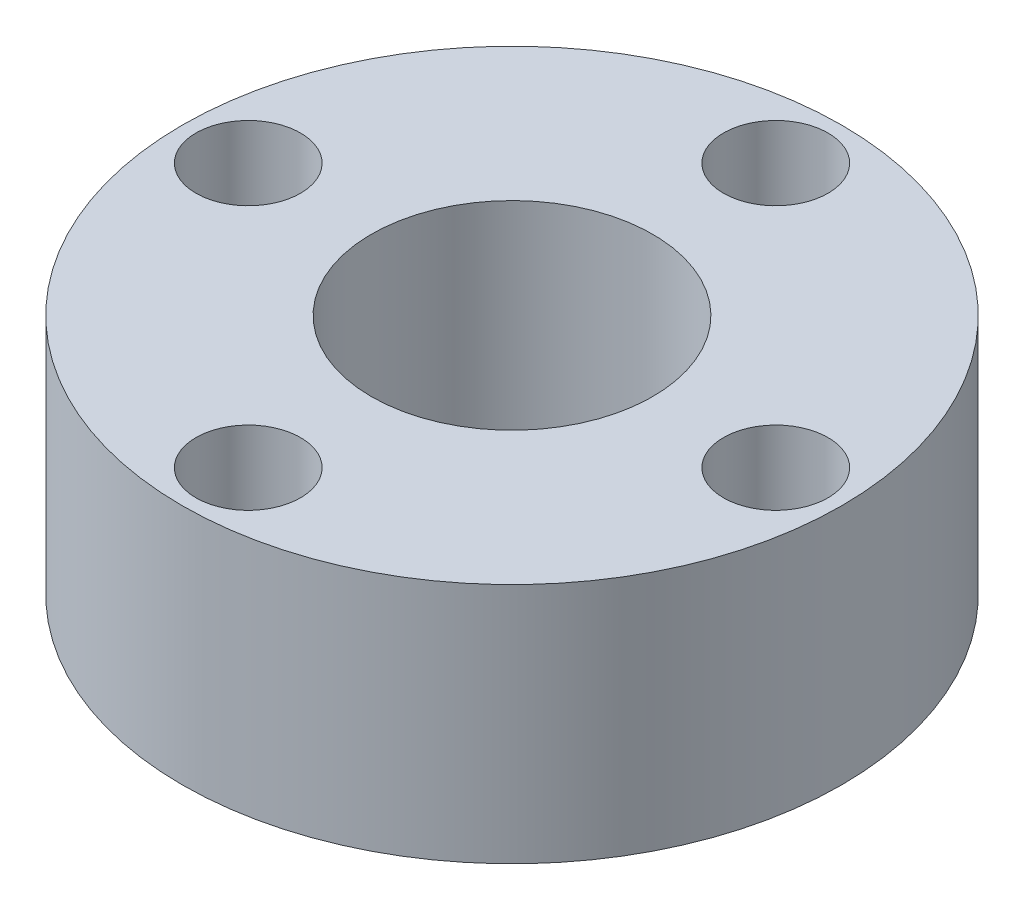
ISO-10303-21;
HEADER;
FILE_DESCRIPTION(('STEP AP214'),'2;1');
FILE_NAME('part.step','',(''),(''),'','','');
FILE_SCHEMA(('AUTOMOTIVE_DESIGN { 1 0 10303 214 1 1 1 1 }'));
ENDSEC;
DATA;
#1=APPLICATION_CONTEXT('core data for automotive mechanical design processes');
#2=APPLICATION_PROTOCOL_DEFINITION('international standard','automotive_design',2000,#1);
#3=PRODUCT_CONTEXT('',#1,'mechanical');
#4=PRODUCT('Part','Part','',(#3));
#5=PRODUCT_RELATED_PRODUCT_CATEGORY('part','',(#4));
#6=PRODUCT_DEFINITION_FORMATION('','',#4);
#7=PRODUCT_DEFINITION_CONTEXT('part definition',#1,'design');
#8=PRODUCT_DEFINITION('design','',#6,#7);
#9=PRODUCT_DEFINITION_SHAPE('','',#8);
#10=(LENGTH_UNIT() NAMED_UNIT(*) SI_UNIT(.MILLI.,.METRE.));
#11=(NAMED_UNIT(*) PLANE_ANGLE_UNIT() SI_UNIT($,.RADIAN.));
#12=(NAMED_UNIT(*) SI_UNIT($,.STERADIAN.) SOLID_ANGLE_UNIT());
#13=UNCERTAINTY_MEASURE_WITH_UNIT(LENGTH_MEASURE(1.E-05),#10,'distance_accuracy_value','');
#14=(GEOMETRIC_REPRESENTATION_CONTEXT(3) GLOBAL_UNCERTAINTY_ASSIGNED_CONTEXT((#13)) GLOBAL_UNIT_ASSIGNED_CONTEXT((#10,
#11,#12)) REPRESENTATION_CONTEXT('',''));
#15=CARTESIAN_POINT('',(0.,0.,0.));
#16=DIRECTION('',(0.,0.,1.));
#17=DIRECTION('',(1.,0.,0.));
#18=AXIS2_PLACEMENT_3D('',#15,#16,#17);
#19=CARTESIAN_POINT('',(0.,6.985,0.));
#20=DIRECTION('',(0.,1.,0.));
#21=DIRECTION('',(0.,0.,1.));
#22=AXIS2_PLACEMENT_3D('',#19,#20,#21);
#23=PLANE('',#22);
#24=CARTESIAN_POINT('',(0.,6.985,7.62));
#25=DIRECTION('',(0.,1.,0.));
#26=DIRECTION('',(0.,0.,1.));
#27=AXIS2_PLACEMENT_3D('',#24,#25,#26);
#28=CIRCLE('',#27,1.51);
#29=CARTESIAN_POINT('',(0.,6.985,9.13));
#30=VERTEX_POINT('',#29);
#31=EDGE_CURVE('E72',#30,#30,#28,.T.);
#32=ORIENTED_EDGE('',*,*,#31,.F.);
#33=EDGE_LOOP('',(#32));
#34=FACE_BOUND('',#33,.T.);
#35=CARTESIAN_POINT('',(0.,6.985,0.));
#36=DIRECTION('',(0.,1.,0.));
#37=DIRECTION('',(0.,0.,1.));
#38=AXIS2_PLACEMENT_3D('',#35,#36,#37);
#39=CIRCLE('',#38,4.064);
#40=CARTESIAN_POINT('',(0.,6.985,4.064));
#41=VERTEX_POINT('',#40);
#42=EDGE_CURVE('E56',#41,#41,#39,.T.);
#43=ORIENTED_EDGE('',*,*,#42,.F.);
#44=EDGE_LOOP('',(#43));
#45=FACE_BOUND('',#44,.T.);
#46=CARTESIAN_POINT('',(0.,6.985,0.));
#47=DIRECTION('',(0.,1.,0.));
#48=DIRECTION('',(0.,0.,1.));
#49=AXIS2_PLACEMENT_3D('',#46,#47,#48);
#50=CIRCLE('',#49,9.525);
#51=CARTESIAN_POINT('',(0.,6.985,9.525));
#52=VERTEX_POINT('',#51);
#53=EDGE_CURVE('E10',#52,#52,#50,.T.);
#54=ORIENTED_EDGE('',*,*,#53,.T.);
#55=EDGE_LOOP('',(#54));
#56=FACE_BOUND('',#55,.T.);
#57=CARTESIAN_POINT('',(0.,6.985,-7.62));
#58=DIRECTION('',(0.,1.,0.));
#59=DIRECTION('',(0.,0.,1.));
#60=AXIS2_PLACEMENT_3D('',#57,#58,#59);
#61=CIRCLE('',#60,1.51);
#62=CARTESIAN_POINT('',(0.,6.985,-6.11));
#63=VERTEX_POINT('',#62);
#64=EDGE_CURVE('E50',#63,#63,#61,.T.);
#65=ORIENTED_EDGE('',*,*,#64,.F.);
#66=EDGE_LOOP('',(#65));
#67=FACE_BOUND('',#66,.T.);
#68=CARTESIAN_POINT('',(7.62,6.985,0.));
#69=DIRECTION('',(0.,1.,0.));
#70=DIRECTION('',(0.,0.,1.));
#71=AXIS2_PLACEMENT_3D('',#68,#69,#70);
#72=CIRCLE('',#71,1.51);
#73=CARTESIAN_POINT('',(7.62,6.985,1.51));
#74=VERTEX_POINT('',#73);
#75=EDGE_CURVE('E64',#74,#74,#72,.T.);
#76=ORIENTED_EDGE('',*,*,#75,.F.);
#77=EDGE_LOOP('',(#76));
#78=FACE_BOUND('',#77,.T.);
#79=CARTESIAN_POINT('',(-7.62,6.985,0.));
#80=DIRECTION('',(0.,1.,0.));
#81=DIRECTION('',(0.,0.,1.));
#82=AXIS2_PLACEMENT_3D('',#79,#80,#81);
#83=CIRCLE('',#82,1.51);
#84=CARTESIAN_POINT('',(-7.62,6.985,1.51));
#85=VERTEX_POINT('',#84);
#86=EDGE_CURVE('E80',#85,#85,#83,.T.);
#87=ORIENTED_EDGE('',*,*,#86,.F.);
#88=EDGE_LOOP('',(#87));
#89=FACE_BOUND('',#88,.T.);
#90=ADVANCED_FACE('F37',(#34,#45,#56,#67,#78,#89),#23,.T.);
#91=CARTESIAN_POINT('',(0.,0.,0.));
#92=DIRECTION('',(0.,1.,0.));
#93=DIRECTION('',(0.,0.,1.));
#94=AXIS2_PLACEMENT_3D('',#91,#92,#93);
#95=PLANE('',#94);
#96=CARTESIAN_POINT('',(0.,0.,0.));
#97=DIRECTION('',(0.,1.,0.));
#98=DIRECTION('',(0.,0.,1.));
#99=AXIS2_PLACEMENT_3D('',#96,#97,#98);
#100=CIRCLE('',#99,9.525);
#101=CARTESIAN_POINT('',(0.,0.,9.525));
#102=VERTEX_POINT('',#101);
#103=EDGE_CURVE('E41',#102,#102,#100,.T.);
#104=ORIENTED_EDGE('',*,*,#103,.F.);
#105=EDGE_LOOP('',(#104));
#106=FACE_BOUND('',#105,.T.);
#107=CARTESIAN_POINT('',(0.,0.,-7.62));
#108=DIRECTION('',(0.,1.,0.));
#109=DIRECTION('',(0.,0.,1.));
#110=AXIS2_PLACEMENT_3D('',#107,#108,#109);
#111=CIRCLE('',#110,1.51);
#112=CARTESIAN_POINT('',(0.,0.,-6.11));
#113=VERTEX_POINT('',#112);
#114=EDGE_CURVE('E52',#113,#113,#111,.T.);
#115=ORIENTED_EDGE('',*,*,#114,.T.);
#116=EDGE_LOOP('',(#115));
#117=FACE_BOUND('',#116,.T.);
#118=CARTESIAN_POINT('',(0.,0.,0.));
#119=DIRECTION('',(0.,1.,0.));
#120=DIRECTION('',(0.,0.,1.));
#121=AXIS2_PLACEMENT_3D('',#118,#119,#120);
#122=CIRCLE('',#121,4.064);
#123=CARTESIAN_POINT('',(0.,0.,4.064));
#124=VERTEX_POINT('',#123);
#125=EDGE_CURVE('E60',#124,#124,#122,.T.);
#126=ORIENTED_EDGE('',*,*,#125,.T.);
#127=EDGE_LOOP('',(#126));
#128=FACE_BOUND('',#127,.T.);
#129=CARTESIAN_POINT('',(7.62,0.,0.));
#130=DIRECTION('',(0.,1.,0.));
#131=DIRECTION('',(0.,0.,1.));
#132=AXIS2_PLACEMENT_3D('',#129,#130,#131);
#133=CIRCLE('',#132,1.51);
#134=CARTESIAN_POINT('',(7.62,0.,1.51));
#135=VERTEX_POINT('',#134);
#136=EDGE_CURVE('E68',#135,#135,#133,.T.);
#137=ORIENTED_EDGE('',*,*,#136,.T.);
#138=EDGE_LOOP('',(#137));
#139=FACE_BOUND('',#138,.T.);
#140=CARTESIAN_POINT('',(0.,0.,7.62));
#141=DIRECTION('',(0.,1.,0.));
#142=DIRECTION('',(0.,0.,1.));
#143=AXIS2_PLACEMENT_3D('',#140,#141,#142);
#144=CIRCLE('',#143,1.51);
#145=CARTESIAN_POINT('',(0.,0.,9.13));
#146=VERTEX_POINT('',#145);
#147=EDGE_CURVE('E76',#146,#146,#144,.T.);
#148=ORIENTED_EDGE('',*,*,#147,.T.);
#149=EDGE_LOOP('',(#148));
#150=FACE_BOUND('',#149,.T.);
#151=CARTESIAN_POINT('',(-7.62,0.,0.));
#152=DIRECTION('',(0.,1.,0.));
#153=DIRECTION('',(0.,0.,1.));
#154=AXIS2_PLACEMENT_3D('',#151,#152,#153);
#155=CIRCLE('',#154,1.51);
#156=CARTESIAN_POINT('',(-7.62,0.,1.51));
#157=VERTEX_POINT('',#156);
#158=EDGE_CURVE('E84',#157,#157,#155,.T.);
#159=ORIENTED_EDGE('',*,*,#158,.T.);
#160=EDGE_LOOP('',(#159));
#161=FACE_BOUND('',#160,.T.);
#162=ADVANCED_FACE('F96',(#106,#117,#128,#139,#150,#161),#95,.F.);
#163=CARTESIAN_POINT('',(0.,6.985,0.));
#164=DIRECTION('',(0.,-1.,0.));
#165=DIRECTION('',(0.,0.,-1.));
#166=AXIS2_PLACEMENT_3D('',#163,#164,#165);
#167=CYLINDRICAL_SURFACE('',#166,9.525);
#168=ORIENTED_EDGE('',*,*,#53,.F.);
#169=EDGE_LOOP('',(#168));
#170=FACE_BOUND('',#169,.T.);
#171=ORIENTED_EDGE('',*,*,#103,.T.);
#172=EDGE_LOOP('',(#171));
#173=FACE_BOUND('',#172,.T.);
#174=ADVANCED_FACE('F39',(#170,#173),#167,.T.);
#175=CARTESIAN_POINT('',(0.,6.985,-7.62));
#176=DIRECTION('',(0.,-1.,0.));
#177=DIRECTION('',(0.,0.,-1.));
#178=AXIS2_PLACEMENT_3D('',#175,#176,#177);
#179=CYLINDRICAL_SURFACE('',#178,1.51);
#180=ORIENTED_EDGE('',*,*,#64,.T.);
#181=EDGE_LOOP('',(#180));
#182=FACE_BOUND('',#181,.T.);
#183=ORIENTED_EDGE('',*,*,#114,.F.);
#184=EDGE_LOOP('',(#183));
#185=FACE_BOUND('',#184,.T.);
#186=ADVANCED_FACE('F106',(#182,#185),#179,.F.);
#187=CARTESIAN_POINT('',(0.,6.985,0.));
#188=DIRECTION('',(0.,-1.,0.));
#189=DIRECTION('',(0.,0.,-1.));
#190=AXIS2_PLACEMENT_3D('',#187,#188,#189);
#191=CYLINDRICAL_SURFACE('',#190,4.064);
#192=ORIENTED_EDGE('',*,*,#42,.T.);
#193=EDGE_LOOP('',(#192));
#194=FACE_BOUND('',#193,.T.);
#195=ORIENTED_EDGE('',*,*,#125,.F.);
#196=EDGE_LOOP('',(#195));
#197=FACE_BOUND('',#196,.T.);
#198=ADVANCED_FACE('F109',(#194,#197),#191,.F.);
#199=CARTESIAN_POINT('',(7.62,6.985,0.));
#200=DIRECTION('',(0.,-1.,0.));
#201=DIRECTION('',(0.,0.,-1.));
#202=AXIS2_PLACEMENT_3D('',#199,#200,#201);
#203=CYLINDRICAL_SURFACE('',#202,1.51);
#204=ORIENTED_EDGE('',*,*,#75,.T.);
#205=EDGE_LOOP('',(#204));
#206=FACE_BOUND('',#205,.T.);
#207=ORIENTED_EDGE('',*,*,#136,.F.);
#208=EDGE_LOOP('',(#207));
#209=FACE_BOUND('',#208,.T.);
#210=ADVANCED_FACE('F113',(#206,#209),#203,.F.);
#211=CARTESIAN_POINT('',(0.,6.985,7.62));
#212=DIRECTION('',(0.,-1.,0.));
#213=DIRECTION('',(0.,0.,-1.));
#214=AXIS2_PLACEMENT_3D('',#211,#212,#213);
#215=CYLINDRICAL_SURFACE('',#214,1.51);
#216=ORIENTED_EDGE('',*,*,#31,.T.);
#217=EDGE_LOOP('',(#216));
#218=FACE_BOUND('',#217,.T.);
#219=ORIENTED_EDGE('',*,*,#147,.F.);
#220=EDGE_LOOP('',(#219));
#221=FACE_BOUND('',#220,.T.);
#222=ADVANCED_FACE('F117',(#218,#221),#215,.F.);
#223=CARTESIAN_POINT('',(-7.62,6.985,0.));
#224=DIRECTION('',(0.,-1.,0.));
#225=DIRECTION('',(0.,0.,-1.));
#226=AXIS2_PLACEMENT_3D('',#223,#224,#225);
#227=CYLINDRICAL_SURFACE('',#226,1.51);
#228=ORIENTED_EDGE('',*,*,#86,.T.);
#229=EDGE_LOOP('',(#228));
#230=FACE_BOUND('',#229,.T.);
#231=ORIENTED_EDGE('',*,*,#158,.F.);
#232=EDGE_LOOP('',(#231));
#233=FACE_BOUND('',#232,.T.);
#234=ADVANCED_FACE('F92',(#230,#233),#227,.F.);
#235=CLOSED_SHELL('',(#90,#162,#174,#186,#198,#210,#222,#234));
#236=MANIFOLD_SOLID_BREP('B2',#235);
#237=ADVANCED_BREP_SHAPE_REPRESENTATION('',(#18,#236),#14);
#238=SHAPE_DEFINITION_REPRESENTATION(#9,#237);
ENDSEC;
END-ISO-10303-21;
